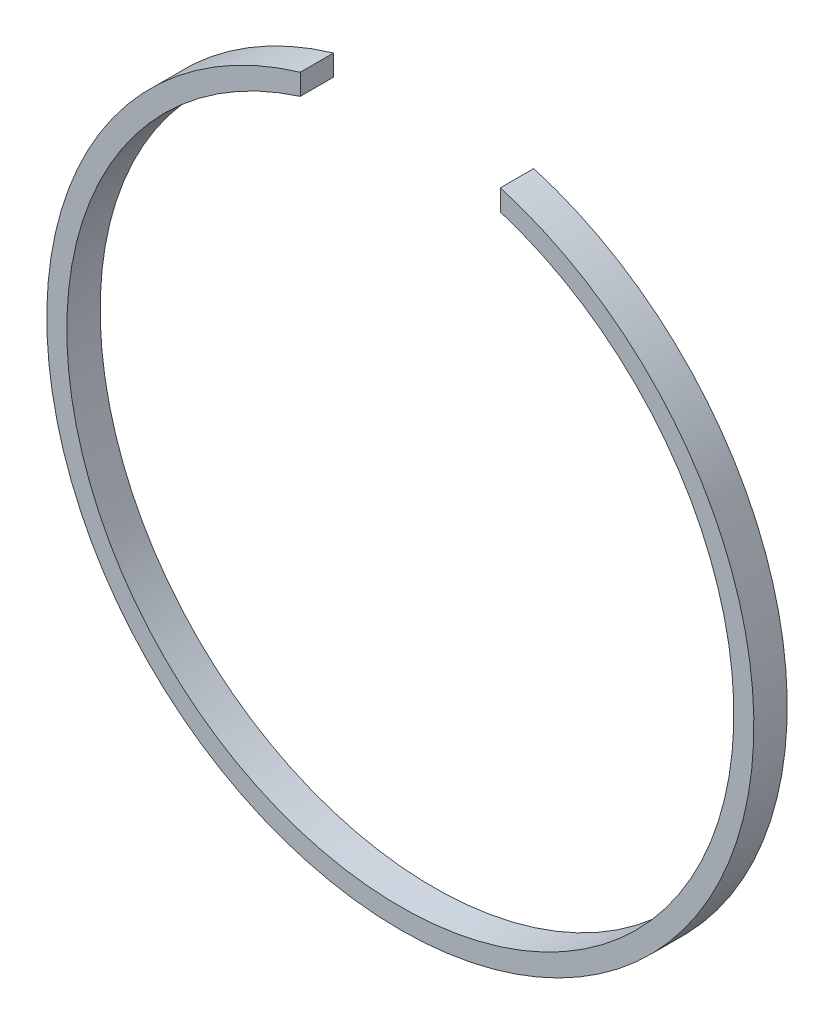
ISO-10303-21;
HEADER;
FILE_DESCRIPTION(('STEP AP214'),'2;1');
FILE_NAME('part.step','',(''),(''),'','','');
FILE_SCHEMA(('AUTOMOTIVE_DESIGN { 1 0 10303 214 1 1 1 1 }'));
ENDSEC;
DATA;
#1=APPLICATION_CONTEXT('core data for automotive mechanical design processes');
#2=APPLICATION_PROTOCOL_DEFINITION('international standard','automotive_design',2000,#1);
#3=PRODUCT_CONTEXT('',#1,'mechanical');
#4=PRODUCT('Part','Part','',(#3));
#5=PRODUCT_RELATED_PRODUCT_CATEGORY('part','',(#4));
#6=PRODUCT_DEFINITION_FORMATION('','',#4);
#7=PRODUCT_DEFINITION_CONTEXT('part definition',#1,'design');
#8=PRODUCT_DEFINITION('design','',#6,#7);
#9=PRODUCT_DEFINITION_SHAPE('','',#8);
#10=(LENGTH_UNIT() NAMED_UNIT(*) SI_UNIT(.MILLI.,.METRE.));
#11=(NAMED_UNIT(*) PLANE_ANGLE_UNIT() SI_UNIT($,.RADIAN.));
#12=(NAMED_UNIT(*) SI_UNIT($,.STERADIAN.) SOLID_ANGLE_UNIT());
#13=UNCERTAINTY_MEASURE_WITH_UNIT(LENGTH_MEASURE(1.E-05),#10,'distance_accuracy_value','');
#14=(GEOMETRIC_REPRESENTATION_CONTEXT(3) GLOBAL_UNCERTAINTY_ASSIGNED_CONTEXT((#13)) GLOBAL_UNIT_ASSIGNED_CONTEXT((#10,
#11,#12)) REPRESENTATION_CONTEXT('',''));
#15=CARTESIAN_POINT('',(0.,0.,0.));
#16=DIRECTION('',(0.,0.,1.));
#17=DIRECTION('',(1.,0.,0.));
#18=AXIS2_PLACEMENT_3D('',#15,#16,#17);
#19=CARTESIAN_POINT('',(0.,0.,5.));
#20=DIRECTION('',(0.,0.,1.));
#21=DIRECTION('',(1.,0.,0.));
#22=AXIS2_PLACEMENT_3D('',#19,#20,#21);
#23=PLANE('',#22);
#24=DIRECTION('',(0.,-1.,0.));
#25=VECTOR('',#24,1.);
#26=CARTESIAN_POINT('',(-15.,65.,5.));
#27=LINE('',#26,#25);
#28=CARTESIAN_POINT('',(-15.,50.8330601085553,5.));
#29=VERTEX_POINT('',#28);
#30=CARTESIAN_POINT('',(-15.,47.6969600708473,5.));
#31=VERTEX_POINT('',#30);
#32=EDGE_CURVE('E63',#29,#31,#27,.T.);
#33=ORIENTED_EDGE('',*,*,#32,.F.);
#34=CARTESIAN_POINT('',(0.,0.,5.));
#35=DIRECTION('',(0.,0.,1.));
#36=DIRECTION('',(1.,0.,0.));
#37=AXIS2_PLACEMENT_3D('',#34,#35,#36);
#38=CIRCLE('',#37,53.);
#39=CARTESIAN_POINT('',(15.,50.8330601085553,5.));
#40=VERTEX_POINT('',#39);
#41=EDGE_CURVE('E93',#29,#40,#38,.T.);
#42=ORIENTED_EDGE('',*,*,#41,.T.);
#43=DIRECTION('',(0.,1.,0.));
#44=VECTOR('',#43,1.);
#45=CARTESIAN_POINT('',(15.,65.,5.));
#46=LINE('',#45,#44);
#47=CARTESIAN_POINT('',(15.,47.6969600708473,5.));
#48=VERTEX_POINT('',#47);
#49=EDGE_CURVE('E96',#48,#40,#46,.T.);
#50=ORIENTED_EDGE('',*,*,#49,.F.);
#51=CARTESIAN_POINT('',(0.,0.,5.));
#52=DIRECTION('',(0.,0.,1.));
#53=DIRECTION('',(1.,0.,0.));
#54=AXIS2_PLACEMENT_3D('',#51,#52,#53);
#55=CIRCLE('',#54,50.);
#56=EDGE_CURVE('E95',#31,#48,#55,.T.);
#57=ORIENTED_EDGE('',*,*,#56,.F.);
#58=EDGE_LOOP('',(#33,#42,#50,#57));
#59=FACE_BOUND('',#58,.T.);
#60=ADVANCED_FACE('F41',(#59),#23,.T.);
#61=CARTESIAN_POINT('',(0.,0.,0.));
#62=DIRECTION('',(0.,0.,1.));
#63=DIRECTION('',(1.,0.,0.));
#64=AXIS2_PLACEMENT_3D('',#61,#62,#63);
#65=PLANE('',#64);
#66=CARTESIAN_POINT('',(0.,0.,0.));
#67=DIRECTION('',(0.,0.,1.));
#68=DIRECTION('',(1.,0.,0.));
#69=AXIS2_PLACEMENT_3D('',#66,#67,#68);
#70=CIRCLE('',#69,53.);
#71=CARTESIAN_POINT('',(-15.,50.8330601085553,0.));
#72=VERTEX_POINT('',#71);
#73=CARTESIAN_POINT('',(15.,50.8330601085553,0.));
#74=VERTEX_POINT('',#73);
#75=EDGE_CURVE('E100',#72,#74,#70,.T.);
#76=ORIENTED_EDGE('',*,*,#75,.F.);
#77=DIRECTION('',(0.,-1.,0.));
#78=VECTOR('',#77,1.);
#79=CARTESIAN_POINT('',(-15.,0.,0.));
#80=LINE('',#79,#78);
#81=CARTESIAN_POINT('',(-15.,47.6969600708473,0.));
#82=VERTEX_POINT('',#81);
#83=EDGE_CURVE('E82',#72,#82,#80,.T.);
#84=ORIENTED_EDGE('',*,*,#83,.T.);
#85=CARTESIAN_POINT('',(0.,0.,0.));
#86=DIRECTION('',(0.,0.,1.));
#87=DIRECTION('',(1.,0.,0.));
#88=AXIS2_PLACEMENT_3D('',#85,#86,#87);
#89=CIRCLE('',#88,50.);
#90=CARTESIAN_POINT('',(15.,47.6969600708473,0.));
#91=VERTEX_POINT('',#90);
#92=EDGE_CURVE('E87',#82,#91,#89,.T.);
#93=ORIENTED_EDGE('',*,*,#92,.T.);
#94=DIRECTION('',(0.,1.,0.));
#95=VECTOR('',#94,1.);
#96=CARTESIAN_POINT('',(15.,0.,0.));
#97=LINE('',#96,#95);
#98=EDGE_CURVE('E56',#91,#74,#97,.T.);
#99=ORIENTED_EDGE('',*,*,#98,.T.);
#100=EDGE_LOOP('',(#76,#84,#93,#99));
#101=FACE_BOUND('',#100,.T.);
#102=ADVANCED_FACE('F115',(#101),#65,.F.);
#103=CARTESIAN_POINT('',(0.,0.,5.));
#104=DIRECTION('',(0.,0.,-1.));
#105=DIRECTION('',(-1.,0.,0.));
#106=AXIS2_PLACEMENT_3D('',#103,#104,#105);
#107=CYLINDRICAL_SURFACE('',#106,53.);
#108=ORIENTED_EDGE('',*,*,#41,.F.);
#109=DIRECTION('',(0.,0.,-1.));
#110=VECTOR('',#109,1.);
#111=CARTESIAN_POINT('',(-15.,50.8330601085553,5.));
#112=LINE('',#111,#110);
#113=EDGE_CURVE('E79',#29,#72,#112,.T.);
#114=ORIENTED_EDGE('',*,*,#113,.T.);
#115=ORIENTED_EDGE('',*,*,#75,.T.);
#116=DIRECTION('',(0.,0.,-1.));
#117=VECTOR('',#116,1.);
#118=CARTESIAN_POINT('',(15.,50.8330601085553,5.));
#119=LINE('',#118,#117);
#120=EDGE_CURVE('E99',#74,#40,#119,.F.);
#121=ORIENTED_EDGE('',*,*,#120,.T.);
#122=EDGE_LOOP('',(#108,#114,#115,#121));
#123=FACE_BOUND('',#122,.T.);
#124=ADVANCED_FACE('F43',(#123),#107,.T.);
#125=CARTESIAN_POINT('',(0.,0.,5.));
#126=DIRECTION('',(0.,0.,-1.));
#127=DIRECTION('',(-1.,0.,0.));
#128=AXIS2_PLACEMENT_3D('',#125,#126,#127);
#129=CYLINDRICAL_SURFACE('',#128,50.);
#130=DIRECTION('',(0.,0.,-1.));
#131=VECTOR('',#130,1.);
#132=CARTESIAN_POINT('',(-15.,47.6969600708473,5.));
#133=LINE('',#132,#131);
#134=EDGE_CURVE('E12',#31,#82,#133,.T.);
#135=ORIENTED_EDGE('',*,*,#134,.F.);
#136=ORIENTED_EDGE('',*,*,#56,.T.);
#137=DIRECTION('',(0.,0.,-1.));
#138=VECTOR('',#137,1.);
#139=CARTESIAN_POINT('',(15.,47.6969600708473,5.));
#140=LINE('',#139,#138);
#141=EDGE_CURVE('E49',#91,#48,#140,.F.);
#142=ORIENTED_EDGE('',*,*,#141,.F.);
#143=ORIENTED_EDGE('',*,*,#92,.F.);
#144=EDGE_LOOP('',(#135,#136,#142,#143));
#145=FACE_BOUND('',#144,.T.);
#146=ADVANCED_FACE('F112',(#145),#129,.F.);
#147=CARTESIAN_POINT('',(15.,65.,-5.));
#148=DIRECTION('',(1.,0.,0.));
#149=DIRECTION('',(0.,1.,0.));
#150=AXIS2_PLACEMENT_3D('',#147,#148,#149);
#151=PLANE('',#150);
#152=ORIENTED_EDGE('',*,*,#98,.F.);
#153=ORIENTED_EDGE('',*,*,#141,.T.);
#154=ORIENTED_EDGE('',*,*,#49,.T.);
#155=ORIENTED_EDGE('',*,*,#120,.F.);
#156=EDGE_LOOP('',(#152,#153,#154,#155));
#157=FACE_BOUND('',#156,.T.);
#158=ADVANCED_FACE('F110',(#157),#151,.F.);
#159=CARTESIAN_POINT('',(-15.,65.,-5.));
#160=DIRECTION('',(-1.,0.,0.));
#161=DIRECTION('',(0.,-1.,0.));
#162=AXIS2_PLACEMENT_3D('',#159,#160,#161);
#163=PLANE('',#162);
#164=ORIENTED_EDGE('',*,*,#32,.T.);
#165=ORIENTED_EDGE('',*,*,#134,.T.);
#166=ORIENTED_EDGE('',*,*,#83,.F.);
#167=ORIENTED_EDGE('',*,*,#113,.F.);
#168=EDGE_LOOP('',(#164,#165,#166,#167));
#169=FACE_BOUND('',#168,.T.);
#170=ADVANCED_FACE('F80',(#169),#163,.F.);
#171=CLOSED_SHELL('',(#60,#102,#124,#146,#158,#170));
#172=MANIFOLD_SOLID_BREP('B2',#171);
#173=ADVANCED_BREP_SHAPE_REPRESENTATION('',(#18,#172),#14);
#174=SHAPE_DEFINITION_REPRESENTATION(#9,#173);
ENDSEC;
END-ISO-10303-21;
